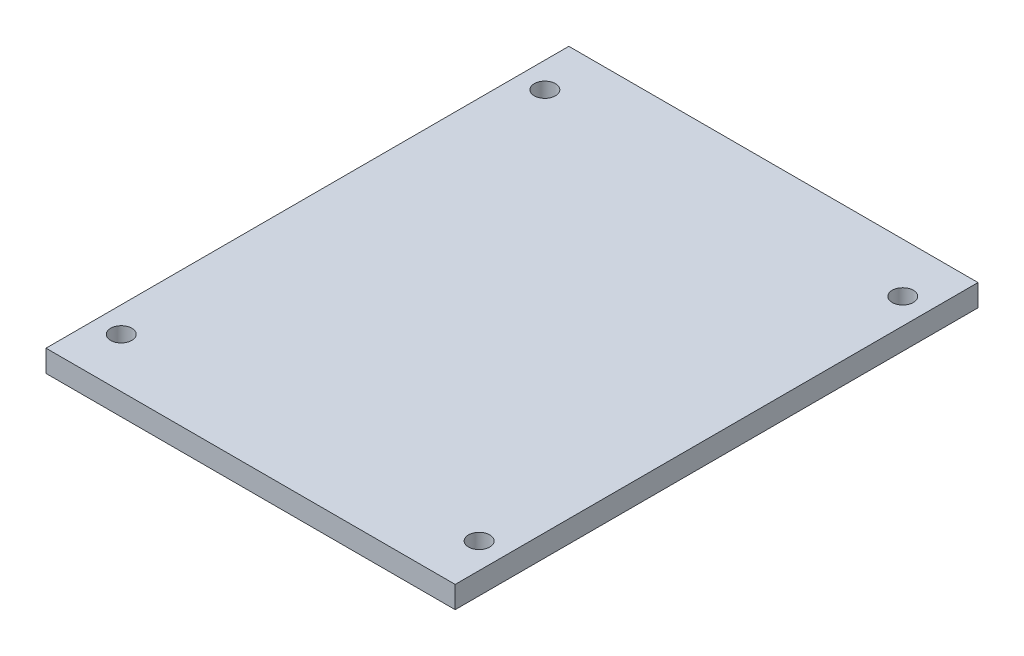
ISO-10303-21;
HEADER;
FILE_DESCRIPTION(('STEP AP214'),'2;1');
FILE_NAME('part.step','',(''),(''),'','','');
FILE_SCHEMA(('AUTOMOTIVE_DESIGN { 1 0 10303 214 1 1 1 1 }'));
ENDSEC;
DATA;
#1=APPLICATION_CONTEXT('core data for automotive mechanical design processes');
#2=APPLICATION_PROTOCOL_DEFINITION('international standard','automotive_design',2000,#1);
#3=PRODUCT_CONTEXT('',#1,'mechanical');
#4=PRODUCT('Part','Part','',(#3));
#5=PRODUCT_RELATED_PRODUCT_CATEGORY('part','',(#4));
#6=PRODUCT_DEFINITION_FORMATION('','',#4);
#7=PRODUCT_DEFINITION_CONTEXT('part definition',#1,'design');
#8=PRODUCT_DEFINITION('design','',#6,#7);
#9=PRODUCT_DEFINITION_SHAPE('','',#8);
#10=(LENGTH_UNIT() NAMED_UNIT(*) SI_UNIT(.MILLI.,.METRE.));
#11=(NAMED_UNIT(*) PLANE_ANGLE_UNIT() SI_UNIT($,.RADIAN.));
#12=(NAMED_UNIT(*) SI_UNIT($,.STERADIAN.) SOLID_ANGLE_UNIT());
#13=UNCERTAINTY_MEASURE_WITH_UNIT(LENGTH_MEASURE(1.E-05),#10,'distance_accuracy_value','');
#14=(GEOMETRIC_REPRESENTATION_CONTEXT(3) GLOBAL_UNCERTAINTY_ASSIGNED_CONTEXT((#13)) GLOBAL_UNIT_ASSIGNED_CONTEXT((#10,
#11,#12)) REPRESENTATION_CONTEXT('',''));
#15=CARTESIAN_POINT('',(0.,0.,0.));
#16=DIRECTION('',(0.,0.,1.));
#17=DIRECTION('',(1.,0.,0.));
#18=AXIS2_PLACEMENT_3D('',#15,#16,#17);
#19=CARTESIAN_POINT('',(0.,3.,0.));
#20=DIRECTION('',(0.,-1.,0.));
#21=DIRECTION('',(0.,0.,-1.));
#22=AXIS2_PLACEMENT_3D('',#19,#20,#21);
#23=PLANE('',#22);
#24=DIRECTION('',(0.,0.,-1.));
#25=VECTOR('',#24,1.);
#26=CARTESIAN_POINT('',(28.01,3.,35.79));
#27=LINE('',#26,#25);
#28=CARTESIAN_POINT('',(28.01,3.,35.79));
#29=VERTEX_POINT('',#28);
#30=CARTESIAN_POINT('',(28.01,3.,-35.79));
#31=VERTEX_POINT('',#30);
#32=EDGE_CURVE('E85',#29,#31,#27,.T.);
#33=ORIENTED_EDGE('',*,*,#32,.T.);
#34=DIRECTION('',(-1.,0.,0.));
#35=VECTOR('',#34,1.);
#36=CARTESIAN_POINT('',(-28.01,3.,-35.79));
#37=LINE('',#36,#35);
#38=CARTESIAN_POINT('',(-28.01,3.,-35.79));
#39=VERTEX_POINT('',#38);
#40=EDGE_CURVE('E80',#31,#39,#37,.T.);
#41=ORIENTED_EDGE('',*,*,#40,.T.);
#42=DIRECTION('',(0.,0.,1.));
#43=VECTOR('',#42,1.);
#44=CARTESIAN_POINT('',(-28.01,3.,35.79));
#45=LINE('',#44,#43);
#46=CARTESIAN_POINT('',(-28.01,3.,35.79));
#47=VERTEX_POINT('',#46);
#48=EDGE_CURVE('E83',#39,#47,#45,.T.);
#49=ORIENTED_EDGE('',*,*,#48,.T.);
#50=DIRECTION('',(1.,0.,0.));
#51=VECTOR('',#50,1.);
#52=CARTESIAN_POINT('',(-28.01,3.,35.79));
#53=LINE('',#52,#51);
#54=EDGE_CURVE('E50',#47,#29,#53,.T.);
#55=ORIENTED_EDGE('',*,*,#54,.T.);
#56=EDGE_LOOP('',(#33,#41,#49,#55));
#57=FACE_BOUND('',#56,.T.);
#58=CARTESIAN_POINT('',(-24.5,3.,-29.));
#59=DIRECTION('',(0.,1.,0.));
#60=DIRECTION('',(0.,0.,1.));
#61=AXIS2_PLACEMENT_3D('',#58,#59,#60);
#62=CIRCLE('',#61,1.45);
#63=CARTESIAN_POINT('',(-24.5,3.,-27.55));
#64=VERTEX_POINT('',#63);
#65=EDGE_CURVE('E100',#64,#64,#62,.T.);
#66=ORIENTED_EDGE('',*,*,#65,.F.);
#67=EDGE_LOOP('',(#66));
#68=FACE_BOUND('',#67,.T.);
#69=CARTESIAN_POINT('',(-24.5,3.,29.));
#70=DIRECTION('',(0.,1.,0.));
#71=DIRECTION('',(0.,0.,1.));
#72=AXIS2_PLACEMENT_3D('',#69,#70,#71);
#73=CIRCLE('',#72,1.45);
#74=CARTESIAN_POINT('',(-24.5,3.,30.45));
#75=VERTEX_POINT('',#74);
#76=EDGE_CURVE('E115',#75,#75,#73,.T.);
#77=ORIENTED_EDGE('',*,*,#76,.F.);
#78=EDGE_LOOP('',(#77));
#79=FACE_BOUND('',#78,.T.);
#80=CARTESIAN_POINT('',(24.5,3.,29.));
#81=DIRECTION('',(0.,1.,0.));
#82=DIRECTION('',(0.,0.,1.));
#83=AXIS2_PLACEMENT_3D('',#80,#81,#82);
#84=CIRCLE('',#83,1.45);
#85=CARTESIAN_POINT('',(24.5,3.,30.45));
#86=VERTEX_POINT('',#85);
#87=EDGE_CURVE('E121',#86,#86,#84,.T.);
#88=ORIENTED_EDGE('',*,*,#87,.F.);
#89=EDGE_LOOP('',(#88));
#90=FACE_BOUND('',#89,.T.);
#91=CARTESIAN_POINT('',(24.5,3.,-29.));
#92=DIRECTION('',(0.,1.,0.));
#93=DIRECTION('',(0.,0.,1.));
#94=AXIS2_PLACEMENT_3D('',#91,#92,#93);
#95=CIRCLE('',#94,1.45);
#96=CARTESIAN_POINT('',(24.5,3.,-27.55));
#97=VERTEX_POINT('',#96);
#98=EDGE_CURVE('E127',#97,#97,#95,.T.);
#99=ORIENTED_EDGE('',*,*,#98,.F.);
#100=EDGE_LOOP('',(#99));
#101=FACE_BOUND('',#100,.T.);
#102=ADVANCED_FACE('F33',(#57,#68,#79,#90,#101),#23,.F.);
#103=CARTESIAN_POINT('',(0.,0.,0.));
#104=DIRECTION('',(0.,-1.,0.));
#105=DIRECTION('',(0.,0.,-1.));
#106=AXIS2_PLACEMENT_3D('',#103,#104,#105);
#107=PLANE('',#106);
#108=CARTESIAN_POINT('',(24.5,0.,29.));
#109=DIRECTION('',(0.,1.,0.));
#110=DIRECTION('',(0.,0.,1.));
#111=AXIS2_PLACEMENT_3D('',#108,#109,#110);
#112=CIRCLE('',#111,1.45);
#113=CARTESIAN_POINT('',(24.5,0.,30.45));
#114=VERTEX_POINT('',#113);
#115=EDGE_CURVE('E124',#114,#114,#112,.T.);
#116=ORIENTED_EDGE('',*,*,#115,.T.);
#117=EDGE_LOOP('',(#116));
#118=FACE_BOUND('',#117,.T.);
#119=CARTESIAN_POINT('',(-24.5,0.,-29.));
#120=DIRECTION('',(0.,1.,0.));
#121=DIRECTION('',(0.,0.,1.));
#122=AXIS2_PLACEMENT_3D('',#119,#120,#121);
#123=CIRCLE('',#122,1.45);
#124=CARTESIAN_POINT('',(-24.5,0.,-27.55));
#125=VERTEX_POINT('',#124);
#126=EDGE_CURVE('E112',#125,#125,#123,.T.);
#127=ORIENTED_EDGE('',*,*,#126,.T.);
#128=EDGE_LOOP('',(#127));
#129=FACE_BOUND('',#128,.T.);
#130=DIRECTION('',(0.,0.,-1.));
#131=VECTOR('',#130,1.);
#132=CARTESIAN_POINT('',(28.01,0.,35.79));
#133=LINE('',#132,#131);
#134=CARTESIAN_POINT('',(28.01,0.,35.79));
#135=VERTEX_POINT('',#134);
#136=CARTESIAN_POINT('',(28.01,0.,-35.79));
#137=VERTEX_POINT('',#136);
#138=EDGE_CURVE('E97',#135,#137,#133,.T.);
#139=ORIENTED_EDGE('',*,*,#138,.F.);
#140=DIRECTION('',(1.,0.,0.));
#141=VECTOR('',#140,1.);
#142=CARTESIAN_POINT('',(-28.01,0.,35.79));
#143=LINE('',#142,#141);
#144=CARTESIAN_POINT('',(-28.01,0.,35.79));
#145=VERTEX_POINT('',#144);
#146=EDGE_CURVE('E73',#145,#135,#143,.T.);
#147=ORIENTED_EDGE('',*,*,#146,.F.);
#148=DIRECTION('',(0.,0.,1.));
#149=VECTOR('',#148,1.);
#150=CARTESIAN_POINT('',(-28.01,0.,35.79));
#151=LINE('',#150,#149);
#152=CARTESIAN_POINT('',(-28.01,0.,-35.79));
#153=VERTEX_POINT('',#152);
#154=EDGE_CURVE('E67',#153,#145,#151,.T.);
#155=ORIENTED_EDGE('',*,*,#154,.F.);
#156=DIRECTION('',(-1.,0.,0.));
#157=VECTOR('',#156,1.);
#158=CARTESIAN_POINT('',(-28.01,0.,-35.79));
#159=LINE('',#158,#157);
#160=EDGE_CURVE('E89',#137,#153,#159,.T.);
#161=ORIENTED_EDGE('',*,*,#160,.F.);
#162=EDGE_LOOP('',(#139,#147,#155,#161));
#163=FACE_BOUND('',#162,.T.);
#164=CARTESIAN_POINT('',(-24.5,0.,29.));
#165=DIRECTION('',(0.,1.,0.));
#166=DIRECTION('',(0.,0.,1.));
#167=AXIS2_PLACEMENT_3D('',#164,#165,#166);
#168=CIRCLE('',#167,1.45);
#169=CARTESIAN_POINT('',(-24.5,0.,30.45));
#170=VERTEX_POINT('',#169);
#171=EDGE_CURVE('E118',#170,#170,#168,.T.);
#172=ORIENTED_EDGE('',*,*,#171,.T.);
#173=EDGE_LOOP('',(#172));
#174=FACE_BOUND('',#173,.T.);
#175=CARTESIAN_POINT('',(24.5,0.,-29.));
#176=DIRECTION('',(0.,1.,0.));
#177=DIRECTION('',(0.,0.,1.));
#178=AXIS2_PLACEMENT_3D('',#175,#176,#177);
#179=CIRCLE('',#178,1.45);
#180=CARTESIAN_POINT('',(24.5,0.,-27.55));
#181=VERTEX_POINT('',#180);
#182=EDGE_CURVE('E130',#181,#181,#179,.T.);
#183=ORIENTED_EDGE('',*,*,#182,.T.);
#184=EDGE_LOOP('',(#183));
#185=FACE_BOUND('',#184,.T.);
#186=ADVANCED_FACE('F108',(#118,#129,#163,#174,#185),#107,.T.);
#187=CARTESIAN_POINT('',(28.01,3.,35.79));
#188=DIRECTION('',(-1.,0.,0.));
#189=DIRECTION('',(0.,0.,1.));
#190=AXIS2_PLACEMENT_3D('',#187,#188,#189);
#191=PLANE('',#190);
#192=ORIENTED_EDGE('',*,*,#138,.T.);
#193=DIRECTION('',(0.,-1.,0.));
#194=VECTOR('',#193,1.);
#195=CARTESIAN_POINT('',(28.01,3.,-35.79));
#196=LINE('',#195,#194);
#197=EDGE_CURVE('E11',#31,#137,#196,.T.);
#198=ORIENTED_EDGE('',*,*,#197,.F.);
#199=ORIENTED_EDGE('',*,*,#32,.F.);
#200=DIRECTION('',(0.,-1.,0.));
#201=VECTOR('',#200,1.);
#202=CARTESIAN_POINT('',(28.01,3.,35.79));
#203=LINE('',#202,#201);
#204=EDGE_CURVE('E93',#29,#135,#203,.T.);
#205=ORIENTED_EDGE('',*,*,#204,.T.);
#206=EDGE_LOOP('',(#192,#198,#199,#205));
#207=FACE_BOUND('',#206,.T.);
#208=ADVANCED_FACE('F35',(#207),#191,.F.);
#209=CARTESIAN_POINT('',(-28.01,3.,-35.79));
#210=DIRECTION('',(0.,0.,1.));
#211=DIRECTION('',(1.,0.,0.));
#212=AXIS2_PLACEMENT_3D('',#209,#210,#211);
#213=PLANE('',#212);
#214=ORIENTED_EDGE('',*,*,#160,.T.);
#215=DIRECTION('',(0.,-1.,0.));
#216=VECTOR('',#215,1.);
#217=CARTESIAN_POINT('',(-28.01,3.,-35.79));
#218=LINE('',#217,#216);
#219=EDGE_CURVE('E42',#39,#153,#218,.T.);
#220=ORIENTED_EDGE('',*,*,#219,.F.);
#221=ORIENTED_EDGE('',*,*,#40,.F.);
#222=ORIENTED_EDGE('',*,*,#197,.T.);
#223=EDGE_LOOP('',(#214,#220,#221,#222));
#224=FACE_BOUND('',#223,.T.);
#225=ADVANCED_FACE('F88',(#224),#213,.F.);
#226=CARTESIAN_POINT('',(-28.01,3.,35.79));
#227=DIRECTION('',(1.,0.,0.));
#228=DIRECTION('',(0.,0.,-1.));
#229=AXIS2_PLACEMENT_3D('',#226,#227,#228);
#230=PLANE('',#229);
#231=ORIENTED_EDGE('',*,*,#154,.T.);
#232=DIRECTION('',(0.,-1.,0.));
#233=VECTOR('',#232,1.);
#234=CARTESIAN_POINT('',(-28.01,3.,35.79));
#235=LINE('',#234,#233);
#236=EDGE_CURVE('E90',#47,#145,#235,.T.);
#237=ORIENTED_EDGE('',*,*,#236,.F.);
#238=ORIENTED_EDGE('',*,*,#48,.F.);
#239=ORIENTED_EDGE('',*,*,#219,.T.);
#240=EDGE_LOOP('',(#231,#237,#238,#239));
#241=FACE_BOUND('',#240,.T.);
#242=ADVANCED_FACE('F91',(#241),#230,.F.);
#243=CARTESIAN_POINT('',(-28.01,3.,35.79));
#244=DIRECTION('',(0.,0.,-1.));
#245=DIRECTION('',(-1.,0.,0.));
#246=AXIS2_PLACEMENT_3D('',#243,#244,#245);
#247=PLANE('',#246);
#248=ORIENTED_EDGE('',*,*,#146,.T.);
#249=ORIENTED_EDGE('',*,*,#204,.F.);
#250=ORIENTED_EDGE('',*,*,#54,.F.);
#251=ORIENTED_EDGE('',*,*,#236,.T.);
#252=EDGE_LOOP('',(#248,#249,#250,#251));
#253=FACE_BOUND('',#252,.T.);
#254=ADVANCED_FACE('F105',(#253),#247,.F.);
#255=CARTESIAN_POINT('',(-24.5,3.,-29.));
#256=DIRECTION('',(0.,-1.,0.));
#257=DIRECTION('',(0.,0.,-1.));
#258=AXIS2_PLACEMENT_3D('',#255,#256,#257);
#259=CYLINDRICAL_SURFACE('',#258,1.45);
#260=ORIENTED_EDGE('',*,*,#65,.T.);
#261=EDGE_LOOP('',(#260));
#262=FACE_BOUND('',#261,.T.);
#263=ORIENTED_EDGE('',*,*,#126,.F.);
#264=EDGE_LOOP('',(#263));
#265=FACE_BOUND('',#264,.T.);
#266=ADVANCED_FACE('F147',(#262,#265),#259,.F.);
#267=CARTESIAN_POINT('',(-24.5,3.,29.));
#268=DIRECTION('',(0.,-1.,0.));
#269=DIRECTION('',(0.,0.,-1.));
#270=AXIS2_PLACEMENT_3D('',#267,#268,#269);
#271=CYLINDRICAL_SURFACE('',#270,1.45);
#272=ORIENTED_EDGE('',*,*,#76,.T.);
#273=EDGE_LOOP('',(#272));
#274=FACE_BOUND('',#273,.T.);
#275=ORIENTED_EDGE('',*,*,#171,.F.);
#276=EDGE_LOOP('',(#275));
#277=FACE_BOUND('',#276,.T.);
#278=ADVANCED_FACE('F193',(#274,#277),#271,.F.);
#279=CARTESIAN_POINT('',(24.5,3.,29.));
#280=DIRECTION('',(0.,-1.,0.));
#281=DIRECTION('',(0.,0.,-1.));
#282=AXIS2_PLACEMENT_3D('',#279,#280,#281);
#283=CYLINDRICAL_SURFACE('',#282,1.45);
#284=ORIENTED_EDGE('',*,*,#87,.T.);
#285=EDGE_LOOP('',(#284));
#286=FACE_BOUND('',#285,.T.);
#287=ORIENTED_EDGE('',*,*,#115,.F.);
#288=EDGE_LOOP('',(#287));
#289=FACE_BOUND('',#288,.T.);
#290=ADVANCED_FACE('F201',(#286,#289),#283,.F.);
#291=CARTESIAN_POINT('',(24.5,3.,-29.));
#292=DIRECTION('',(0.,-1.,0.));
#293=DIRECTION('',(0.,0.,-1.));
#294=AXIS2_PLACEMENT_3D('',#291,#292,#293);
#295=CYLINDRICAL_SURFACE('',#294,1.45);
#296=ORIENTED_EDGE('',*,*,#98,.T.);
#297=EDGE_LOOP('',(#296));
#298=FACE_BOUND('',#297,.T.);
#299=ORIENTED_EDGE('',*,*,#182,.F.);
#300=EDGE_LOOP('',(#299));
#301=FACE_BOUND('',#300,.T.);
#302=ADVANCED_FACE('F136',(#298,#301),#295,.F.);
#303=CLOSED_SHELL('',(#102,#186,#208,#225,#242,#254,#266,#278,#290,#302));
#304=MANIFOLD_SOLID_BREP('B2',#303);
#305=ADVANCED_BREP_SHAPE_REPRESENTATION('',(#18,#304),#14);
#306=SHAPE_DEFINITION_REPRESENTATION(#9,#305);
ENDSEC;
END-ISO-10303-21;
